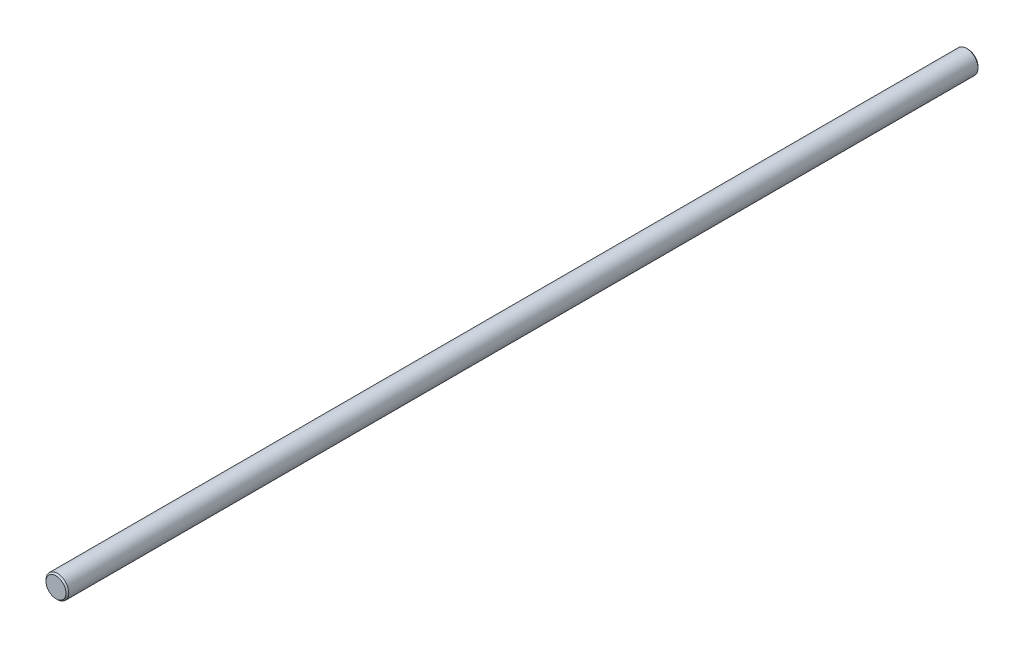
ISO-10303-21;
HEADER;
FILE_DESCRIPTION(('STEP AP214'),'2;1');
FILE_NAME('part.step','',(''),(''),'','','');
FILE_SCHEMA(('AUTOMOTIVE_DESIGN { 1 0 10303 214 1 1 1 1 }'));
ENDSEC;
DATA;
#1=APPLICATION_CONTEXT('core data for automotive mechanical design processes');
#2=APPLICATION_PROTOCOL_DEFINITION('international standard','automotive_design',2000,#1);
#3=PRODUCT_CONTEXT('',#1,'mechanical');
#4=PRODUCT('Part','Part','',(#3));
#5=PRODUCT_RELATED_PRODUCT_CATEGORY('part','',(#4));
#6=PRODUCT_DEFINITION_FORMATION('','',#4);
#7=PRODUCT_DEFINITION_CONTEXT('part definition',#1,'design');
#8=PRODUCT_DEFINITION('design','',#6,#7);
#9=PRODUCT_DEFINITION_SHAPE('','',#8);
#10=(LENGTH_UNIT() NAMED_UNIT(*) SI_UNIT(.MILLI.,.METRE.));
#11=(NAMED_UNIT(*) PLANE_ANGLE_UNIT() SI_UNIT($,.RADIAN.));
#12=(NAMED_UNIT(*) SI_UNIT($,.STERADIAN.) SOLID_ANGLE_UNIT());
#13=UNCERTAINTY_MEASURE_WITH_UNIT(LENGTH_MEASURE(1.E-05),#10,'distance_accuracy_value','');
#14=(GEOMETRIC_REPRESENTATION_CONTEXT(3) GLOBAL_UNCERTAINTY_ASSIGNED_CONTEXT((#13)) GLOBAL_UNIT_ASSIGNED_CONTEXT((#10,
#11,#12)) REPRESENTATION_CONTEXT('',''));
#15=CARTESIAN_POINT('',(0.,0.,0.));
#16=DIRECTION('',(0.,0.,1.));
#17=DIRECTION('',(1.,0.,0.));
#18=AXIS2_PLACEMENT_3D('',#15,#16,#17);
#19=CARTESIAN_POINT('',(0.,0.,-320.));
#20=DIRECTION('',(0.,0.,1.));
#21=DIRECTION('',(1.,0.,0.));
#22=AXIS2_PLACEMENT_3D('',#19,#20,#21);
#23=CYLINDRICAL_SURFACE('',#22,4.);
#24=CARTESIAN_POINT('',(0.,0.,-319.5));
#25=DIRECTION('',(0.,0.,1.));
#26=DIRECTION('',(1.,0.,0.));
#27=AXIS2_PLACEMENT_3D('',#24,#25,#26);
#28=CIRCLE('',#27,4.);
#29=CARTESIAN_POINT('',(4.,0.,-319.5));
#30=VERTEX_POINT('',#29);
#31=EDGE_CURVE('E43',#30,#30,#28,.T.);
#32=ORIENTED_EDGE('',*,*,#31,.T.);
#33=EDGE_LOOP('',(#32));
#34=FACE_BOUND('',#33,.T.);
#35=CARTESIAN_POINT('',(0.,0.,-0.499999999999945));
#36=DIRECTION('',(0.,0.,1.));
#37=DIRECTION('',(1.,0.,0.));
#38=AXIS2_PLACEMENT_3D('',#35,#36,#37);
#39=CIRCLE('',#38,4.);
#40=CARTESIAN_POINT('',(4.,0.,-0.499999999999945));
#41=VERTEX_POINT('',#40);
#42=EDGE_CURVE('E47',#41,#41,#39,.F.);
#43=ORIENTED_EDGE('',*,*,#42,.T.);
#44=EDGE_LOOP('',(#43));
#45=FACE_BOUND('',#44,.T.);
#46=ADVANCED_FACE('F32',(#34,#45),#23,.T.);
#47=CARTESIAN_POINT('',(0.,0.,-320.));
#48=DIRECTION('',(0.,0.,1.));
#49=DIRECTION('',(1.,0.,0.));
#50=AXIS2_PLACEMENT_3D('',#47,#48,#49);
#51=PLANE('',#50);
#52=CARTESIAN_POINT('',(0.,0.,-320.));
#53=DIRECTION('',(0.,0.,1.));
#54=DIRECTION('',(1.,0.,0.));
#55=AXIS2_PLACEMENT_3D('',#52,#53,#54);
#56=CIRCLE('',#55,3.49999999999998);
#57=CARTESIAN_POINT('',(3.49999999999998,0.,-320.));
#58=VERTEX_POINT('',#57);
#59=EDGE_CURVE('E39',#58,#58,#56,.F.);
#60=ORIENTED_EDGE('',*,*,#59,.T.);
#61=EDGE_LOOP('',(#60));
#62=FACE_BOUND('',#61,.T.);
#63=ADVANCED_FACE('F63',(#62),#51,.F.);
#64=CARTESIAN_POINT('',(0.,0.,0.));
#65=DIRECTION('',(0.,0.,1.));
#66=DIRECTION('',(1.,0.,0.));
#67=AXIS2_PLACEMENT_3D('',#64,#65,#66);
#68=PLANE('',#67);
#69=CARTESIAN_POINT('',(0.,0.,0.));
#70=DIRECTION('',(0.,0.,1.));
#71=DIRECTION('',(1.,0.,0.));
#72=AXIS2_PLACEMENT_3D('',#69,#70,#71);
#73=CIRCLE('',#72,3.50000000000003);
#74=CARTESIAN_POINT('',(3.50000000000003,0.,0.));
#75=VERTEX_POINT('',#74);
#76=EDGE_CURVE('E10',#75,#75,#73,.T.);
#77=ORIENTED_EDGE('',*,*,#76,.T.);
#78=EDGE_LOOP('',(#77));
#79=FACE_BOUND('',#78,.T.);
#80=ADVANCED_FACE('F60',(#79),#68,.T.);
#81=CARTESIAN_POINT('',(0.,0.,-319.5));
#82=DIRECTION('',(0.,0.,1.));
#83=DIRECTION('',(1.,0.,0.));
#84=AXIS2_PLACEMENT_3D('',#81,#82,#83);
#85=CONICAL_SURFACE('',#84,4.,0.785398163397473);
#86=ORIENTED_EDGE('',*,*,#59,.F.);
#87=EDGE_LOOP('',(#86));
#88=FACE_BOUND('',#87,.T.);
#89=ORIENTED_EDGE('',*,*,#31,.F.);
#90=EDGE_LOOP('',(#89));
#91=FACE_BOUND('',#90,.T.);
#92=ADVANCED_FACE('F56',(#88,#91),#85,.T.);
#93=CARTESIAN_POINT('',(0.,0.,0.));
#94=DIRECTION('',(0.,0.,-1.));
#95=DIRECTION('',(-1.,0.,0.));
#96=AXIS2_PLACEMENT_3D('',#93,#94,#95);
#97=CONICAL_SURFACE('',#96,3.50000000000003,0.785398163397473);
#98=ORIENTED_EDGE('',*,*,#42,.F.);
#99=EDGE_LOOP('',(#98));
#100=FACE_BOUND('',#99,.T.);
#101=ORIENTED_EDGE('',*,*,#76,.F.);
#102=EDGE_LOOP('',(#101));
#103=FACE_BOUND('',#102,.T.);
#104=ADVANCED_FACE('F34',(#100,#103),#97,.T.);
#105=CLOSED_SHELL('',(#46,#63,#80,#92,#104));
#106=MANIFOLD_SOLID_BREP('B2',#105);
#107=ADVANCED_BREP_SHAPE_REPRESENTATION('',(#18,#106),#14);
#108=SHAPE_DEFINITION_REPRESENTATION(#9,#107);
ENDSEC;
END-ISO-10303-21;
